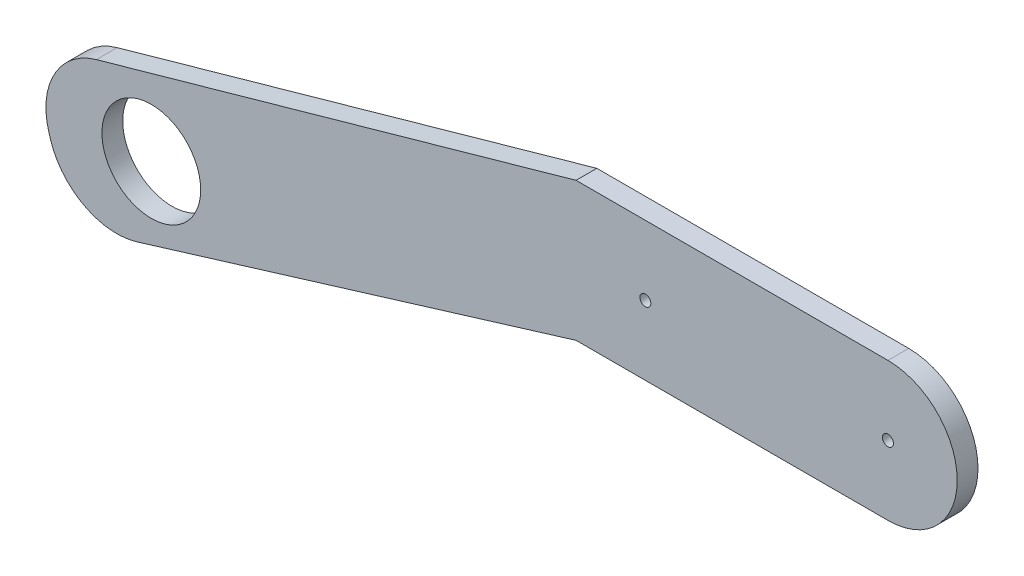
ISO-10303-21;
HEADER;
FILE_DESCRIPTION(('STEP AP214'),'2;1');
FILE_NAME('part.step','',(''),(''),'','','');
FILE_SCHEMA(('AUTOMOTIVE_DESIGN { 1 0 10303 214 1 1 1 1 }'));
ENDSEC;
DATA;
#1=APPLICATION_CONTEXT('core data for automotive mechanical design processes');
#2=APPLICATION_PROTOCOL_DEFINITION('international standard','automotive_design',2000,#1);
#3=PRODUCT_CONTEXT('',#1,'mechanical');
#4=PRODUCT('Part','Part','',(#3));
#5=PRODUCT_RELATED_PRODUCT_CATEGORY('part','',(#4));
#6=PRODUCT_DEFINITION_FORMATION('','',#4);
#7=PRODUCT_DEFINITION_CONTEXT('part definition',#1,'design');
#8=PRODUCT_DEFINITION('design','',#6,#7);
#9=PRODUCT_DEFINITION_SHAPE('','',#8);
#10=(LENGTH_UNIT() NAMED_UNIT(*) SI_UNIT(.MILLI.,.METRE.));
#11=(NAMED_UNIT(*) PLANE_ANGLE_UNIT() SI_UNIT($,.RADIAN.));
#12=(NAMED_UNIT(*) SI_UNIT($,.STERADIAN.) SOLID_ANGLE_UNIT());
#13=UNCERTAINTY_MEASURE_WITH_UNIT(LENGTH_MEASURE(1.E-05),#10,'distance_accuracy_value','');
#14=(GEOMETRIC_REPRESENTATION_CONTEXT(3) GLOBAL_UNCERTAINTY_ASSIGNED_CONTEXT((#13)) GLOBAL_UNIT_ASSIGNED_CONTEXT((#10,
#11,#12)) REPRESENTATION_CONTEXT('',''));
#15=CARTESIAN_POINT('',(0.,0.,0.));
#16=DIRECTION('',(0.,0.,1.));
#17=DIRECTION('',(1.,0.,0.));
#18=AXIS2_PLACEMENT_3D('',#15,#16,#17);
#19=CARTESIAN_POINT('',(200.034775737015,154.962317820145,6.));
#20=DIRECTION('',(0.,0.,-1.));
#21=DIRECTION('',(-1.,0.,0.));
#22=AXIS2_PLACEMENT_3D('',#19,#20,#21);
#23=CYLINDRICAL_SURFACE('',#22,20.);
#24=CARTESIAN_POINT('',(200.034775737015,154.962317820145,0.));
#25=DIRECTION('',(0.,0.,1.));
#26=DIRECTION('',(1.,0.,0.));
#27=AXIS2_PLACEMENT_3D('',#24,#25,#26);
#28=CIRCLE('',#27,20.);
#29=CARTESIAN_POINT('',(200.034775737015,174.962317820145,0.));
#30=VERTEX_POINT('',#29);
#31=CARTESIAN_POINT('',(200.034775737015,134.962317820145,0.));
#32=VERTEX_POINT('',#31);
#33=EDGE_CURVE('E155',#30,#32,#28,.F.);
#34=ORIENTED_EDGE('',*,*,#33,.F.);
#35=DIRECTION('',(0.,0.,-1.));
#36=VECTOR('',#35,1.);
#37=CARTESIAN_POINT('',(200.034775737015,174.962317820145,6.));
#38=LINE('',#37,#36);
#39=CARTESIAN_POINT('',(200.034775737015,174.962317820145,6.));
#40=VERTEX_POINT('',#39);
#41=EDGE_CURVE('E11',#40,#30,#38,.T.);
#42=ORIENTED_EDGE('',*,*,#41,.F.);
#43=CARTESIAN_POINT('',(200.034775737015,154.962317820145,6.));
#44=DIRECTION('',(0.,0.,1.));
#45=DIRECTION('',(1.,0.,0.));
#46=AXIS2_PLACEMENT_3D('',#43,#44,#45);
#47=CIRCLE('',#46,20.);
#48=CARTESIAN_POINT('',(200.034775737015,134.962317820145,6.));
#49=VERTEX_POINT('',#48);
#50=EDGE_CURVE('E193',#40,#49,#47,.F.);
#51=ORIENTED_EDGE('',*,*,#50,.T.);
#52=DIRECTION('',(0.,0.,-1.));
#53=VECTOR('',#52,1.);
#54=CARTESIAN_POINT('',(200.034775737015,134.962317820145,6.));
#55=LINE('',#54,#53);
#56=EDGE_CURVE('E96',#49,#32,#55,.T.);
#57=ORIENTED_EDGE('',*,*,#56,.T.);
#58=EDGE_LOOP('',(#34,#42,#51,#57));
#59=FACE_BOUND('',#58,.T.);
#60=ADVANCED_FACE('F45',(#59),#23,.T.);
#61=CARTESIAN_POINT('',(0.,174.962317820145,6.));
#62=DIRECTION('',(0.,1.,0.));
#63=DIRECTION('',(0.,0.,1.));
#64=AXIS2_PLACEMENT_3D('',#61,#62,#63);
#65=PLANE('',#64);
#66=DIRECTION('',(1.,0.,0.));
#67=VECTOR('',#66,1.);
#68=CARTESIAN_POINT('',(0.,174.962317820145,0.));
#69=LINE('',#68,#67);
#70=CARTESIAN_POINT('',(110.034775737015,174.962317820145,0.));
#71=VERTEX_POINT('',#70);
#72=EDGE_CURVE('E159',#71,#30,#69,.T.);
#73=ORIENTED_EDGE('',*,*,#72,.F.);
#74=DIRECTION('',(0.,0.,-1.));
#75=VECTOR('',#74,1.);
#76=CARTESIAN_POINT('',(110.034775737015,174.962317820145,6.));
#77=LINE('',#76,#75);
#78=CARTESIAN_POINT('',(110.034775737015,174.962317820145,6.));
#79=VERTEX_POINT('',#78);
#80=EDGE_CURVE('E54',#79,#71,#77,.T.);
#81=ORIENTED_EDGE('',*,*,#80,.F.);
#82=DIRECTION('',(1.,0.,0.));
#83=VECTOR('',#82,1.);
#84=CARTESIAN_POINT('',(0.,174.962317820145,6.));
#85=LINE('',#84,#83);
#86=EDGE_CURVE('E224',#79,#40,#85,.T.);
#87=ORIENTED_EDGE('',*,*,#86,.T.);
#88=ORIENTED_EDGE('',*,*,#41,.T.);
#89=EDGE_LOOP('',(#73,#81,#87,#88));
#90=FACE_BOUND('',#89,.T.);
#91=ADVANCED_FACE('F223',(#90),#65,.T.);
#92=CARTESIAN_POINT('',(-37.6058792202668,133.315605846026,6.));
#93=DIRECTION('',(0.271487192729701,-0.962442052377049,0.));
#94=DIRECTION('',(0.962442052377049,0.271487192729701,0.));
#95=AXIS2_PLACEMENT_3D('',#92,#93,#94);
#96=PLANE('',#95);
#97=DIRECTION('',(-0.962442052377049,-0.271487192729701,0.));
#98=VECTOR('',#97,1.);
#99=CARTESIAN_POINT('',(-37.6058792202668,133.315605846026,0.));
#100=LINE('',#99,#98);
#101=CARTESIAN_POINT('',(-28.3869471217407,135.916096950101,0.));
#102=VERTEX_POINT('',#101);
#103=EDGE_CURVE('E163',#71,#102,#100,.T.);
#104=ORIENTED_EDGE('',*,*,#103,.T.);
#105=DIRECTION('',(0.,0.,-1.));
#106=VECTOR('',#105,1.);
#107=CARTESIAN_POINT('',(-28.3869471217407,135.916096950101,6.));
#108=LINE('',#107,#106);
#109=CARTESIAN_POINT('',(-28.3869471217407,135.916096950101,6.));
#110=VERTEX_POINT('',#109);
#111=EDGE_CURVE('E204',#110,#102,#108,.T.);
#112=ORIENTED_EDGE('',*,*,#111,.F.);
#113=DIRECTION('',(-0.962442052377049,-0.271487192729701,0.));
#114=VECTOR('',#113,1.);
#115=CARTESIAN_POINT('',(-37.6058792202668,133.315605846026,6.));
#116=LINE('',#115,#114);
#117=EDGE_CURVE('E213',#79,#110,#116,.T.);
#118=ORIENTED_EDGE('',*,*,#117,.F.);
#119=ORIENTED_EDGE('',*,*,#80,.T.);
#120=EDGE_LOOP('',(#104,#112,#118,#119));
#121=FACE_BOUND('',#120,.T.);
#122=ADVANCED_FACE('F211',(#121),#96,.F.);
#123=CARTESIAN_POINT('',(-22.9564198567665,116.664478655183,6.));
#124=DIRECTION('',(0.,0.,-1.));
#125=DIRECTION('',(-1.,0.,0.));
#126=AXIS2_PLACEMENT_3D('',#123,#124,#125);
#127=CYLINDRICAL_SURFACE('',#126,20.0028856255512);
#128=CARTESIAN_POINT('',(-22.9564198567665,116.664478655183,0.));
#129=DIRECTION('',(0.,0.,1.));
#130=DIRECTION('',(1.,0.,0.));
#131=AXIS2_PLACEMENT_3D('',#128,#129,#130);
#132=CIRCLE('',#131,20.0028856255512);
#133=CARTESIAN_POINT('',(-42.0852745134657,110.816200885466,0.));
#134=VERTEX_POINT('',#133);
#135=EDGE_CURVE('E166',#102,#134,#132,.T.);
#136=ORIENTED_EDGE('',*,*,#135,.T.);
#137=DIRECTION('',(0.,0.,-1.));
#138=VECTOR('',#137,1.);
#139=CARTESIAN_POINT('',(-42.0852745134657,110.816200885466,6.));
#140=LINE('',#139,#138);
#141=CARTESIAN_POINT('',(-42.0852745134657,110.816200885466,6.));
#142=VERTEX_POINT('',#141);
#143=EDGE_CURVE('E200',#142,#134,#140,.T.);
#144=ORIENTED_EDGE('',*,*,#143,.F.);
#145=CARTESIAN_POINT('',(-22.9564198567665,116.664478655183,6.));
#146=DIRECTION('',(0.,0.,1.));
#147=DIRECTION('',(1.,0.,0.));
#148=AXIS2_PLACEMENT_3D('',#145,#146,#147);
#149=CIRCLE('',#148,20.0028856255512);
#150=EDGE_CURVE('E233',#110,#142,#149,.T.);
#151=ORIENTED_EDGE('',*,*,#150,.F.);
#152=ORIENTED_EDGE('',*,*,#111,.T.);
#153=EDGE_LOOP('',(#136,#144,#151,#152));
#154=FACE_BOUND('',#153,.T.);
#155=ADVANCED_FACE('F239',(#154),#127,.T.);
#156=CARTESIAN_POINT('',(-7.50395760584105,-2.29419007247062,6.));
#157=DIRECTION('',(0.956304755963037,0.29237170472273,0.));
#158=DIRECTION('',(-0.29237170472273,0.956304755963038,0.));
#159=AXIS2_PLACEMENT_3D('',#156,#157,#158);
#160=PLANE('',#159);
#161=DIRECTION('',(0.29237170472273,-0.956304755963038,0.));
#162=VECTOR('',#161,1.);
#163=CARTESIAN_POINT('',(-7.50395760584105,-2.29419007247062,0.));
#164=LINE('',#163,#162);
#165=CARTESIAN_POINT('',(-41.6813143743703,109.494906806743,0.));
#166=VERTEX_POINT('',#165);
#167=EDGE_CURVE('E169',#134,#166,#164,.T.);
#168=ORIENTED_EDGE('',*,*,#167,.T.);
#169=DIRECTION('',(0.,0.,-1.));
#170=VECTOR('',#169,1.);
#171=CARTESIAN_POINT('',(-41.6813143743703,109.494906806743,6.));
#172=LINE('',#171,#170);
#173=CARTESIAN_POINT('',(-41.6813143743703,109.494906806743,6.));
#174=VERTEX_POINT('',#173);
#175=EDGE_CURVE('E126',#174,#166,#172,.T.);
#176=ORIENTED_EDGE('',*,*,#175,.F.);
#177=DIRECTION('',(0.29237170472273,-0.956304755963038,0.));
#178=VECTOR('',#177,1.);
#179=CARTESIAN_POINT('',(-7.50395760584105,-2.29419007247062,6.));
#180=LINE('',#179,#178);
#181=EDGE_CURVE('E132',#142,#174,#180,.T.);
#182=ORIENTED_EDGE('',*,*,#181,.F.);
#183=ORIENTED_EDGE('',*,*,#143,.T.);
#184=EDGE_LOOP('',(#168,#176,#182,#183));
#185=FACE_BOUND('',#184,.T.);
#186=ADVANCED_FACE('F241',(#185),#160,.F.);
#187=CARTESIAN_POINT('',(-22.552459717671,115.343184576459,6.));
#188=DIRECTION('',(0.,0.,-1.));
#189=DIRECTION('',(-1.,0.,0.));
#190=AXIS2_PLACEMENT_3D('',#187,#188,#189);
#191=CYLINDRICAL_SURFACE('',#190,20.0028856255512);
#192=CARTESIAN_POINT('',(-22.552459717671,115.343184576459,0.));
#193=DIRECTION('',(0.,0.,1.));
#194=DIRECTION('',(1.,0.,0.));
#195=AXIS2_PLACEMENT_3D('',#192,#193,#194);
#196=CIRCLE('',#195,20.0028856255512);
#197=CARTESIAN_POINT('',(-16.7041819479548,96.2143299197597,0.));
#198=VERTEX_POINT('',#197);
#199=EDGE_CURVE('E120',#198,#166,#196,.F.);
#200=ORIENTED_EDGE('',*,*,#199,.F.);
#201=DIRECTION('',(0.,0.,-1.));
#202=VECTOR('',#201,1.);
#203=CARTESIAN_POINT('',(-16.7041819479548,96.2143299197597,6.));
#204=LINE('',#203,#202);
#205=CARTESIAN_POINT('',(-16.7041819479548,96.2143299197597,6.));
#206=VERTEX_POINT('',#205);
#207=EDGE_CURVE('E115',#206,#198,#204,.T.);
#208=ORIENTED_EDGE('',*,*,#207,.F.);
#209=CARTESIAN_POINT('',(-22.552459717671,115.343184576459,6.));
#210=DIRECTION('',(0.,0.,1.));
#211=DIRECTION('',(1.,0.,0.));
#212=AXIS2_PLACEMENT_3D('',#209,#210,#211);
#213=CIRCLE('',#212,20.0028856255512);
#214=EDGE_CURVE('E118',#206,#174,#213,.F.);
#215=ORIENTED_EDGE('',*,*,#214,.T.);
#216=ORIENTED_EDGE('',*,*,#175,.T.);
#217=EDGE_LOOP('',(#200,#208,#215,#216));
#218=FACE_BOUND('',#217,.T.);
#219=ADVANCED_FACE('F117',(#218),#191,.T.);
#220=CARTESIAN_POINT('',(-28.3290789988131,92.6602422225141,6.));
#221=DIRECTION('',(0.292371704722731,-0.956304755963037,0.));
#222=DIRECTION('',(0.956304755963037,0.292371704722731,0.));
#223=AXIS2_PLACEMENT_3D('',#220,#221,#222);
#224=PLANE('',#223);
#225=DIRECTION('',(-0.956304755963037,-0.292371704722731,0.));
#226=VECTOR('',#225,1.);
#227=CARTESIAN_POINT('',(-28.3290789988131,92.6602422225141,0.));
#228=LINE('',#227,#226);
#229=CARTESIAN_POINT('',(110.034775737015,134.962317820145,0.));
#230=VERTEX_POINT('',#229);
#231=EDGE_CURVE('E175',#230,#198,#228,.T.);
#232=ORIENTED_EDGE('',*,*,#231,.F.);
#233=DIRECTION('',(0.,0.,-1.));
#234=VECTOR('',#233,1.);
#235=CARTESIAN_POINT('',(110.034775737015,134.962317820145,6.));
#236=LINE('',#235,#234);
#237=CARTESIAN_POINT('',(110.034775737015,134.962317820145,6.));
#238=VERTEX_POINT('',#237);
#239=EDGE_CURVE('E89',#238,#230,#236,.T.);
#240=ORIENTED_EDGE('',*,*,#239,.F.);
#241=DIRECTION('',(-0.956304755963037,-0.292371704722731,0.));
#242=VECTOR('',#241,1.);
#243=CARTESIAN_POINT('',(-28.3290789988131,92.6602422225141,6.));
#244=LINE('',#243,#242);
#245=EDGE_CURVE('E130',#238,#206,#244,.T.);
#246=ORIENTED_EDGE('',*,*,#245,.T.);
#247=ORIENTED_EDGE('',*,*,#207,.T.);
#248=EDGE_LOOP('',(#232,#240,#246,#247));
#249=FACE_BOUND('',#248,.T.);
#250=ADVANCED_FACE('F136',(#249),#224,.T.);
#251=CARTESIAN_POINT('',(200.034775737015,154.962317820145,6.));
#252=DIRECTION('',(0.,0.,-1.));
#253=DIRECTION('',(-1.,0.,0.));
#254=AXIS2_PLACEMENT_3D('',#251,#252,#253);
#255=CYLINDRICAL_SURFACE('',#254,1.57999999999999);
#256=CARTESIAN_POINT('',(200.034775737015,154.962317820145,6.));
#257=DIRECTION('',(0.,0.,1.));
#258=DIRECTION('',(1.,0.,0.));
#259=AXIS2_PLACEMENT_3D('',#256,#257,#258);
#260=CIRCLE('',#259,1.57999999999999);
#261=CARTESIAN_POINT('',(201.614775737015,154.962317820145,6.));
#262=VERTEX_POINT('',#261);
#263=EDGE_CURVE('E147',#262,#262,#260,.T.);
#264=ORIENTED_EDGE('',*,*,#263,.T.);
#265=EDGE_LOOP('',(#264));
#266=FACE_BOUND('',#265,.T.);
#267=CARTESIAN_POINT('',(200.034775737015,154.962317820145,0.));
#268=DIRECTION('',(0.,0.,1.));
#269=DIRECTION('',(1.,0.,0.));
#270=AXIS2_PLACEMENT_3D('',#267,#268,#269);
#271=CIRCLE('',#270,1.57999999999999);
#272=CARTESIAN_POINT('',(201.614775737015,154.962317820145,0.));
#273=VERTEX_POINT('',#272);
#274=EDGE_CURVE('E185',#273,#273,#271,.T.);
#275=ORIENTED_EDGE('',*,*,#274,.F.);
#276=EDGE_LOOP('',(#275));
#277=FACE_BOUND('',#276,.T.);
#278=ADVANCED_FACE('F286',(#266,#277),#255,.F.);
#279=CARTESIAN_POINT('',(130.034775737015,154.962317820145,6.));
#280=DIRECTION('',(0.,0.,-1.));
#281=DIRECTION('',(-1.,0.,0.));
#282=AXIS2_PLACEMENT_3D('',#279,#280,#281);
#283=CYLINDRICAL_SURFACE('',#282,1.57999999999999);
#284=CARTESIAN_POINT('',(130.034775737015,154.962317820145,6.));
#285=DIRECTION('',(0.,0.,1.));
#286=DIRECTION('',(1.,0.,0.));
#287=AXIS2_PLACEMENT_3D('',#284,#285,#286);
#288=CIRCLE('',#287,1.57999999999999);
#289=CARTESIAN_POINT('',(131.614775737015,154.962317820145,6.));
#290=VERTEX_POINT('',#289);
#291=EDGE_CURVE('E140',#290,#290,#288,.T.);
#292=ORIENTED_EDGE('',*,*,#291,.T.);
#293=EDGE_LOOP('',(#292));
#294=FACE_BOUND('',#293,.T.);
#295=CARTESIAN_POINT('',(130.034775737015,154.962317820145,0.));
#296=DIRECTION('',(0.,0.,1.));
#297=DIRECTION('',(1.,0.,0.));
#298=AXIS2_PLACEMENT_3D('',#295,#296,#297);
#299=CIRCLE('',#298,1.57999999999999);
#300=CARTESIAN_POINT('',(131.614775737015,154.962317820145,0.));
#301=VERTEX_POINT('',#300);
#302=EDGE_CURVE('E181',#301,#301,#299,.T.);
#303=ORIENTED_EDGE('',*,*,#302,.F.);
#304=EDGE_LOOP('',(#303));
#305=FACE_BOUND('',#304,.T.);
#306=ADVANCED_FACE('F296',(#294,#305),#283,.F.);
#307=CARTESIAN_POINT('',(0.,134.962317820145,6.));
#308=DIRECTION('',(0.,1.,0.));
#309=DIRECTION('',(0.,0.,1.));
#310=AXIS2_PLACEMENT_3D('',#307,#308,#309);
#311=PLANE('',#310);
#312=DIRECTION('',(1.,0.,0.));
#313=VECTOR('',#312,1.);
#314=CARTESIAN_POINT('',(0.,134.962317820145,0.));
#315=LINE('',#314,#313);
#316=EDGE_CURVE('E178',#230,#32,#315,.T.);
#317=ORIENTED_EDGE('',*,*,#316,.T.);
#318=ORIENTED_EDGE('',*,*,#56,.F.);
#319=DIRECTION('',(1.,0.,0.));
#320=VECTOR('',#319,1.);
#321=CARTESIAN_POINT('',(0.,134.962317820145,6.));
#322=LINE('',#321,#320);
#323=EDGE_CURVE('E62',#238,#49,#322,.T.);
#324=ORIENTED_EDGE('',*,*,#323,.F.);
#325=ORIENTED_EDGE('',*,*,#239,.T.);
#326=EDGE_LOOP('',(#317,#318,#324,#325));
#327=FACE_BOUND('',#326,.T.);
#328=ADVANCED_FACE('F225',(#327),#311,.F.);
#329=CARTESIAN_POINT('',(-12.5445532359911,118.399891170226,6.));
#330=DIRECTION('',(0.,0.,-1.));
#331=DIRECTION('',(-1.,0.,0.));
#332=AXIS2_PLACEMENT_3D('',#329,#330,#331);
#333=CYLINDRICAL_SURFACE('',#332,14.25);
#334=CARTESIAN_POINT('',(-12.5445532359911,118.399891170226,6.));
#335=DIRECTION('',(0.,0.,1.));
#336=DIRECTION('',(1.,0.,0.));
#337=AXIS2_PLACEMENT_3D('',#334,#335,#336);
#338=CIRCLE('',#337,14.25);
#339=CARTESIAN_POINT('',(1.70544676400894,118.399891170226,6.));
#340=VERTEX_POINT('',#339);
#341=EDGE_CURVE('E151',#340,#340,#338,.T.);
#342=ORIENTED_EDGE('',*,*,#341,.T.);
#343=EDGE_LOOP('',(#342));
#344=FACE_BOUND('',#343,.T.);
#345=CARTESIAN_POINT('',(-12.5445532359911,118.399891170226,0.));
#346=DIRECTION('',(0.,0.,1.));
#347=DIRECTION('',(1.,0.,0.));
#348=AXIS2_PLACEMENT_3D('',#345,#346,#347);
#349=CIRCLE('',#348,14.25);
#350=CARTESIAN_POINT('',(1.70544676400894,118.399891170226,0.));
#351=VERTEX_POINT('',#350);
#352=EDGE_CURVE('E189',#351,#351,#349,.T.);
#353=ORIENTED_EDGE('',*,*,#352,.F.);
#354=EDGE_LOOP('',(#353));
#355=FACE_BOUND('',#354,.T.);
#356=ADVANCED_FACE('F317',(#344,#355),#333,.F.);
#357=CARTESIAN_POINT('',(0.,0.,6.));
#358=DIRECTION('',(0.,0.,1.));
#359=DIRECTION('',(1.,0.,0.));
#360=AXIS2_PLACEMENT_3D('',#357,#358,#359);
#361=PLANE('',#360);
#362=ORIENTED_EDGE('',*,*,#50,.F.);
#363=ORIENTED_EDGE('',*,*,#86,.F.);
#364=ORIENTED_EDGE('',*,*,#117,.T.);
#365=ORIENTED_EDGE('',*,*,#150,.T.);
#366=ORIENTED_EDGE('',*,*,#181,.T.);
#367=ORIENTED_EDGE('',*,*,#214,.F.);
#368=ORIENTED_EDGE('',*,*,#245,.F.);
#369=ORIENTED_EDGE('',*,*,#323,.T.);
#370=EDGE_LOOP('',(#362,#363,#364,#365,#366,#367,#368,#369));
#371=FACE_BOUND('',#370,.T.);
#372=ORIENTED_EDGE('',*,*,#291,.F.);
#373=EDGE_LOOP('',(#372));
#374=FACE_BOUND('',#373,.T.);
#375=ORIENTED_EDGE('',*,*,#263,.F.);
#376=EDGE_LOOP('',(#375));
#377=FACE_BOUND('',#376,.T.);
#378=ORIENTED_EDGE('',*,*,#341,.F.);
#379=EDGE_LOOP('',(#378));
#380=FACE_BOUND('',#379,.T.);
#381=ADVANCED_FACE('F128',(#371,#374,#377,#380),#361,.T.);
#382=CARTESIAN_POINT('',(0.,0.,0.));
#383=DIRECTION('',(0.,0.,1.));
#384=DIRECTION('',(1.,0.,0.));
#385=AXIS2_PLACEMENT_3D('',#382,#383,#384);
#386=PLANE('',#385);
#387=ORIENTED_EDGE('',*,*,#33,.T.);
#388=ORIENTED_EDGE('',*,*,#316,.F.);
#389=ORIENTED_EDGE('',*,*,#231,.T.);
#390=ORIENTED_EDGE('',*,*,#199,.T.);
#391=ORIENTED_EDGE('',*,*,#167,.F.);
#392=ORIENTED_EDGE('',*,*,#135,.F.);
#393=ORIENTED_EDGE('',*,*,#103,.F.);
#394=ORIENTED_EDGE('',*,*,#72,.T.);
#395=EDGE_LOOP('',(#387,#388,#389,#390,#391,#392,#393,#394));
#396=FACE_BOUND('',#395,.T.);
#397=ORIENTED_EDGE('',*,*,#302,.T.);
#398=EDGE_LOOP('',(#397));
#399=FACE_BOUND('',#398,.T.);
#400=ORIENTED_EDGE('',*,*,#274,.T.);
#401=EDGE_LOOP('',(#400));
#402=FACE_BOUND('',#401,.T.);
#403=ORIENTED_EDGE('',*,*,#352,.T.);
#404=EDGE_LOOP('',(#403));
#405=FACE_BOUND('',#404,.T.);
#406=ADVANCED_FACE('F220',(#396,#399,#402,#405),#386,.F.);
#407=CLOSED_SHELL('',(#60,#91,#122,#155,#186,#219,#250,#278,#306,#328,#356,#381,#406));
#408=MANIFOLD_SOLID_BREP('B2',#407);
#409=ADVANCED_BREP_SHAPE_REPRESENTATION('',(#18,#408),#14);
#410=SHAPE_DEFINITION_REPRESENTATION(#9,#409);
ENDSEC;
END-ISO-10303-21;
